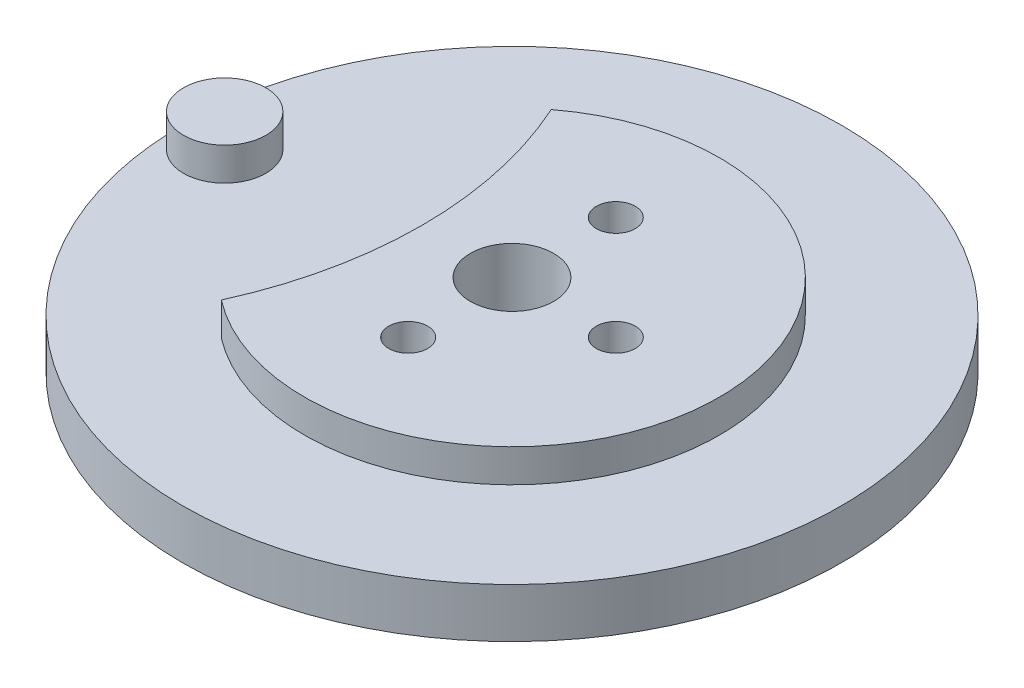
ISO-10303-21;
HEADER;
FILE_DESCRIPTION(('STEP AP214'),'2;1');
FILE_NAME('part.step','',(''),(''),'','','');
FILE_SCHEMA(('AUTOMOTIVE_DESIGN { 1 0 10303 214 1 1 1 1 }'));
ENDSEC;
DATA;
#1=APPLICATION_CONTEXT('core data for automotive mechanical design processes');
#2=APPLICATION_PROTOCOL_DEFINITION('international standard','automotive_design',2000,#1);
#3=PRODUCT_CONTEXT('',#1,'mechanical');
#4=PRODUCT('Part','Part','',(#3));
#5=PRODUCT_RELATED_PRODUCT_CATEGORY('part','',(#4));
#6=PRODUCT_DEFINITION_FORMATION('','',#4);
#7=PRODUCT_DEFINITION_CONTEXT('part definition',#1,'design');
#8=PRODUCT_DEFINITION('design','',#6,#7);
#9=PRODUCT_DEFINITION_SHAPE('','',#8);
#10=(LENGTH_UNIT() NAMED_UNIT(*) SI_UNIT(.MILLI.,.METRE.));
#11=(NAMED_UNIT(*) PLANE_ANGLE_UNIT() SI_UNIT($,.RADIAN.));
#12=(NAMED_UNIT(*) SI_UNIT($,.STERADIAN.) SOLID_ANGLE_UNIT());
#13=UNCERTAINTY_MEASURE_WITH_UNIT(LENGTH_MEASURE(1.E-05),#10,'distance_accuracy_value','');
#14=(GEOMETRIC_REPRESENTATION_CONTEXT(3) GLOBAL_UNCERTAINTY_ASSIGNED_CONTEXT((#13)) GLOBAL_UNIT_ASSIGNED_CONTEXT((#10,
#11,#12)) REPRESENTATION_CONTEXT('',''));
#15=CARTESIAN_POINT('',(0.,0.,0.));
#16=DIRECTION('',(0.,0.,1.));
#17=DIRECTION('',(1.,0.,0.));
#18=AXIS2_PLACEMENT_3D('',#15,#16,#17);
#19=CARTESIAN_POINT('',(37.6753519541933,0.,0.));
#20=DIRECTION('',(0.,1.,0.));
#21=DIRECTION('',(0.,0.,1.));
#22=AXIS2_PLACEMENT_3D('',#19,#20,#21);
#23=PLANE('',#22);
#24=CARTESIAN_POINT('',(15.5303357005903,0.,0.));
#25=DIRECTION('',(0.,1.,0.));
#26=DIRECTION('',(0.,0.,1.));
#27=AXIS2_PLACEMENT_3D('',#24,#25,#26);
#28=CIRCLE('',#27,3.175);
#29=CARTESIAN_POINT('',(15.5303357005903,0.,3.175));
#30=VERTEX_POINT('',#29);
#31=EDGE_CURVE('E98',#30,#30,#28,.T.);
#32=ORIENTED_EDGE('',*,*,#31,.F.);
#33=EDGE_LOOP('',(#32));
#34=FACE_BOUND('',#33,.T.);
#35=CARTESIAN_POINT('',(37.6753519541933,0.,0.));
#36=DIRECTION('',(0.,1.,0.));
#37=DIRECTION('',(0.,0.,1.));
#38=AXIS2_PLACEMENT_3D('',#35,#36,#37);
#39=CIRCLE('',#38,25.4);
#40=CARTESIAN_POINT('',(37.6753519541933,0.,25.4));
#41=VERTEX_POINT('',#40);
#42=EDGE_CURVE('E47',#41,#41,#39,.T.);
#43=ORIENTED_EDGE('',*,*,#42,.T.);
#44=EDGE_LOOP('',(#43));
#45=FACE_BOUND('',#44,.T.);
#46=CARTESIAN_POINT('',(0.,0.,0.));
#47=DIRECTION('',(0.,-1.,0.));
#48=DIRECTION('',(0.,0.,-1.));
#49=AXIS2_PLACEMENT_3D('',#46,#47,#48);
#50=CIRCLE('',#49,30.734);
#51=CARTESIAN_POINT('',(27.9809558245366,0.,-12.7139634711341));
#52=VERTEX_POINT('',#51);
#53=CARTESIAN_POINT('',(27.9809558245366,0.,12.713963471134));
#54=VERTEX_POINT('',#53);
#55=EDGE_CURVE('E74',#52,#54,#50,.T.);
#56=ORIENTED_EDGE('',*,*,#55,.F.);
#57=CARTESIAN_POINT('',(37.6753519541933,0.,0.));
#58=DIRECTION('',(0.,1.,0.));
#59=DIRECTION('',(0.,0.,-1.));
#60=AXIS2_PLACEMENT_3D('',#57,#58,#59);
#61=CIRCLE('',#60,15.9883139656449);
#62=EDGE_CURVE('E59',#54,#52,#61,.T.);
#63=ORIENTED_EDGE('',*,*,#62,.F.);
#64=EDGE_LOOP('',(#56,#63));
#65=FACE_BOUND('',#64,.T.);
#66=ADVANCED_FACE('F43',(#34,#45,#65),#23,.T.);
#67=CARTESIAN_POINT('',(37.6753519541933,-3.81,0.));
#68=DIRECTION('',(0.,1.,0.));
#69=DIRECTION('',(0.,0.,1.));
#70=AXIS2_PLACEMENT_3D('',#67,#68,#69);
#71=CYLINDRICAL_SURFACE('',#70,25.4);
#72=CARTESIAN_POINT('',(37.6753519541933,-3.81,0.));
#73=DIRECTION('',(0.,1.,0.));
#74=DIRECTION('',(0.,0.,1.));
#75=AXIS2_PLACEMENT_3D('',#72,#73,#74);
#76=CIRCLE('',#75,25.4);
#77=CARTESIAN_POINT('',(37.6753519541933,-3.81,25.4));
#78=VERTEX_POINT('',#77);
#79=EDGE_CURVE('E12',#78,#78,#76,.T.);
#80=ORIENTED_EDGE('',*,*,#79,.T.);
#81=EDGE_LOOP('',(#80));
#82=FACE_BOUND('',#81,.T.);
#83=ORIENTED_EDGE('',*,*,#42,.F.);
#84=EDGE_LOOP('',(#83));
#85=FACE_BOUND('',#84,.T.);
#86=ADVANCED_FACE('F45',(#82,#85),#71,.T.);
#87=CARTESIAN_POINT('',(37.6753519541933,-3.81,0.));
#88=DIRECTION('',(0.,1.,0.));
#89=DIRECTION('',(0.,0.,1.));
#90=AXIS2_PLACEMENT_3D('',#87,#88,#89);
#91=PLANE('',#90);
#92=CARTESIAN_POINT('',(37.6753519541933,-3.81,8.));
#93=DIRECTION('',(0.,1.,0.));
#94=DIRECTION('',(0.,0.,1.));
#95=AXIS2_PLACEMENT_3D('',#92,#93,#94);
#96=CIRCLE('',#95,1.5);
#97=CARTESIAN_POINT('',(37.6753519541933,-3.81,9.5));
#98=VERTEX_POINT('',#97);
#99=EDGE_CURVE('E279',#98,#98,#96,.T.);
#100=ORIENTED_EDGE('',*,*,#99,.T.);
#101=EDGE_LOOP('',(#100));
#102=FACE_BOUND('',#101,.T.);
#103=CARTESIAN_POINT('',(45.6753519541933,-3.81,0.));
#104=DIRECTION('',(0.,1.,0.));
#105=DIRECTION('',(0.,0.,1.));
#106=AXIS2_PLACEMENT_3D('',#103,#104,#105);
#107=CIRCLE('',#106,1.5);
#108=CARTESIAN_POINT('',(45.6753519541933,-3.81,1.5));
#109=VERTEX_POINT('',#108);
#110=EDGE_CURVE('E284',#109,#109,#107,.T.);
#111=ORIENTED_EDGE('',*,*,#110,.T.);
#112=EDGE_LOOP('',(#111));
#113=FACE_BOUND('',#112,.T.);
#114=CARTESIAN_POINT('',(37.6753519541933,-3.81,-8.));
#115=DIRECTION('',(0.,1.,0.));
#116=DIRECTION('',(0.,0.,1.));
#117=AXIS2_PLACEMENT_3D('',#114,#115,#116);
#118=CIRCLE('',#117,1.5);
#119=CARTESIAN_POINT('',(37.6753519541933,-3.81,-6.49999999999999));
#120=VERTEX_POINT('',#119);
#121=EDGE_CURVE('E280',#120,#120,#118,.T.);
#122=ORIENTED_EDGE('',*,*,#121,.T.);
#123=EDGE_LOOP('',(#122));
#124=FACE_BOUND('',#123,.T.);
#125=CARTESIAN_POINT('',(37.6753519541933,-3.81,0.));
#126=DIRECTION('',(0.,1.,0.));
#127=DIRECTION('',(0.,0.,1.));
#128=AXIS2_PLACEMENT_3D('',#125,#126,#127);
#129=CIRCLE('',#128,3.2131);
#130=CARTESIAN_POINT('',(37.6753519541933,-3.81,3.2131));
#131=VERTEX_POINT('',#130);
#132=EDGE_CURVE('E85',#131,#131,#129,.T.);
#133=ORIENTED_EDGE('',*,*,#132,.T.);
#134=EDGE_LOOP('',(#133));
#135=FACE_BOUND('',#134,.T.);
#136=ORIENTED_EDGE('',*,*,#79,.F.);
#137=EDGE_LOOP('',(#136));
#138=FACE_BOUND('',#137,.T.);
#139=ADVANCED_FACE('F112',(#102,#113,#124,#135,#138),#91,.F.);
#140=CARTESIAN_POINT('',(15.5303357005903,-12.7902561210692,0.));
#141=DIRECTION('',(0.,1.,0.));
#142=DIRECTION('',(0.,0.,1.));
#143=AXIS2_PLACEMENT_3D('',#140,#141,#142);
#144=CYLINDRICAL_SURFACE('',#143,3.175);
#145=ORIENTED_EDGE('',*,*,#31,.T.);
#146=EDGE_LOOP('',(#145));
#147=FACE_BOUND('',#146,.T.);
#148=CARTESIAN_POINT('',(15.5303357005903,2.54,0.));
#149=DIRECTION('',(0.,1.,0.));
#150=DIRECTION('',(0.,0.,1.));
#151=AXIS2_PLACEMENT_3D('',#148,#149,#150);
#152=CIRCLE('',#151,3.175);
#153=CARTESIAN_POINT('',(15.5303357005903,2.54,3.175));
#154=VERTEX_POINT('',#153);
#155=EDGE_CURVE('E101',#154,#154,#152,.T.);
#156=ORIENTED_EDGE('',*,*,#155,.F.);
#157=EDGE_LOOP('',(#156));
#158=FACE_BOUND('',#157,.T.);
#159=ADVANCED_FACE('F110',(#147,#158),#144,.T.);
#160=CARTESIAN_POINT('',(15.5303357005903,2.54,0.));
#161=DIRECTION('',(0.,1.,0.));
#162=DIRECTION('',(0.,0.,1.));
#163=AXIS2_PLACEMENT_3D('',#160,#161,#162);
#164=PLANE('',#163);
#165=ORIENTED_EDGE('',*,*,#155,.T.);
#166=EDGE_LOOP('',(#165));
#167=FACE_BOUND('',#166,.T.);
#168=ADVANCED_FACE('F108',(#167),#164,.T.);
#169=CARTESIAN_POINT('',(37.6753519541933,2.54,0.));
#170=DIRECTION('',(0.,-1.,0.));
#171=DIRECTION('',(0.,0.,-1.));
#172=AXIS2_PLACEMENT_3D('',#169,#170,#171);
#173=CYLINDRICAL_SURFACE('',#172,15.9883139656449);
#174=ORIENTED_EDGE('',*,*,#62,.T.);
#175=DIRECTION('',(0.,-1.,0.));
#176=VECTOR('',#175,1.);
#177=CARTESIAN_POINT('',(27.9809558245366,2.54,-12.7139634711341));
#178=LINE('',#177,#176);
#179=CARTESIAN_POINT('',(27.9809558245366,2.54,-12.7139634711341));
#180=VERTEX_POINT('',#179);
#181=EDGE_CURVE('E78',#180,#52,#178,.T.);
#182=ORIENTED_EDGE('',*,*,#181,.F.);
#183=CARTESIAN_POINT('',(37.6753519541933,2.54,0.));
#184=DIRECTION('',(0.,1.,0.));
#185=DIRECTION('',(0.,0.,-1.));
#186=AXIS2_PLACEMENT_3D('',#183,#184,#185);
#187=CIRCLE('',#186,15.9883139656449);
#188=CARTESIAN_POINT('',(27.9809558245366,2.54,12.713963471134));
#189=VERTEX_POINT('',#188);
#190=EDGE_CURVE('E80',#189,#180,#187,.T.);
#191=ORIENTED_EDGE('',*,*,#190,.F.);
#192=DIRECTION('',(0.,-1.,0.));
#193=VECTOR('',#192,1.);
#194=CARTESIAN_POINT('',(27.9809558245366,2.54,12.713963471134));
#195=LINE('',#194,#193);
#196=EDGE_CURVE('E76',#189,#54,#195,.T.);
#197=ORIENTED_EDGE('',*,*,#196,.T.);
#198=EDGE_LOOP('',(#174,#182,#191,#197));
#199=FACE_BOUND('',#198,.T.);
#200=ADVANCED_FACE('F82',(#199),#173,.T.);
#201=CARTESIAN_POINT('',(0.,2.54,0.));
#202=DIRECTION('',(0.,-1.,0.));
#203=DIRECTION('',(0.,0.,-1.));
#204=AXIS2_PLACEMENT_3D('',#201,#202,#203);
#205=CYLINDRICAL_SURFACE('',#204,30.734);
#206=ORIENTED_EDGE('',*,*,#55,.T.);
#207=ORIENTED_EDGE('',*,*,#196,.F.);
#208=CARTESIAN_POINT('',(0.,2.54,0.));
#209=DIRECTION('',(0.,-1.,0.));
#210=DIRECTION('',(0.,0.,-1.));
#211=AXIS2_PLACEMENT_3D('',#208,#209,#210);
#212=CIRCLE('',#211,30.734);
#213=EDGE_CURVE('E67',#180,#189,#212,.T.);
#214=ORIENTED_EDGE('',*,*,#213,.F.);
#215=ORIENTED_EDGE('',*,*,#181,.T.);
#216=EDGE_LOOP('',(#206,#207,#214,#215));
#217=FACE_BOUND('',#216,.T.);
#218=ADVANCED_FACE('F75',(#217),#205,.F.);
#219=CARTESIAN_POINT('',(18.8376759770967,2.54,0.));
#220=DIRECTION('',(0.,-1.,0.));
#221=DIRECTION('',(0.,0.,-1.));
#222=AXIS2_PLACEMENT_3D('',#219,#220,#221);
#223=PLANE('',#222);
#224=CARTESIAN_POINT('',(37.6753519541933,2.54,8.));
#225=DIRECTION('',(0.,1.,0.));
#226=DIRECTION('',(0.,0.,1.));
#227=AXIS2_PLACEMENT_3D('',#224,#225,#226);
#228=CIRCLE('',#227,1.5);
#229=CARTESIAN_POINT('',(37.6753519541933,2.54,9.5));
#230=VERTEX_POINT('',#229);
#231=EDGE_CURVE('E266',#230,#230,#228,.T.);
#232=ORIENTED_EDGE('',*,*,#231,.F.);
#233=EDGE_LOOP('',(#232));
#234=FACE_BOUND('',#233,.T.);
#235=CARTESIAN_POINT('',(45.6753519541933,2.54,0.));
#236=DIRECTION('',(0.,1.,0.));
#237=DIRECTION('',(0.,0.,1.));
#238=AXIS2_PLACEMENT_3D('',#235,#236,#237);
#239=CIRCLE('',#238,1.5);
#240=CARTESIAN_POINT('',(45.6753519541933,2.54,1.5));
#241=VERTEX_POINT('',#240);
#242=EDGE_CURVE('E270',#241,#241,#239,.T.);
#243=ORIENTED_EDGE('',*,*,#242,.F.);
#244=EDGE_LOOP('',(#243));
#245=FACE_BOUND('',#244,.T.);
#246=CARTESIAN_POINT('',(37.6753519541933,2.54,-8.));
#247=DIRECTION('',(0.,1.,0.));
#248=DIRECTION('',(0.,0.,1.));
#249=AXIS2_PLACEMENT_3D('',#246,#247,#248);
#250=CIRCLE('',#249,1.5);
#251=CARTESIAN_POINT('',(37.6753519541933,2.54,-6.49999999999999));
#252=VERTEX_POINT('',#251);
#253=EDGE_CURVE('E274',#252,#252,#250,.T.);
#254=ORIENTED_EDGE('',*,*,#253,.F.);
#255=EDGE_LOOP('',(#254));
#256=FACE_BOUND('',#255,.T.);
#257=CARTESIAN_POINT('',(37.6753519541933,2.54,0.));
#258=DIRECTION('',(0.,1.,0.));
#259=DIRECTION('',(0.,0.,1.));
#260=AXIS2_PLACEMENT_3D('',#257,#258,#259);
#261=CIRCLE('',#260,3.2131);
#262=CARTESIAN_POINT('',(37.6753519541933,2.54,3.2131));
#263=VERTEX_POINT('',#262);
#264=EDGE_CURVE('E89',#263,#263,#261,.T.);
#265=ORIENTED_EDGE('',*,*,#264,.F.);
#266=EDGE_LOOP('',(#265));
#267=FACE_BOUND('',#266,.T.);
#268=ORIENTED_EDGE('',*,*,#190,.T.);
#269=ORIENTED_EDGE('',*,*,#213,.T.);
#270=EDGE_LOOP('',(#268,#269));
#271=FACE_BOUND('',#270,.T.);
#272=ADVANCED_FACE('F159',(#234,#245,#256,#267,#271),#223,.F.);
#273=CARTESIAN_POINT('',(37.6753519541933,-3.81,0.));
#274=DIRECTION('',(0.,1.,0.));
#275=DIRECTION('',(0.,0.,1.));
#276=AXIS2_PLACEMENT_3D('',#273,#274,#275);
#277=CYLINDRICAL_SURFACE('',#276,3.2131);
#278=ORIENTED_EDGE('',*,*,#132,.F.);
#279=EDGE_LOOP('',(#278));
#280=FACE_BOUND('',#279,.T.);
#281=ORIENTED_EDGE('',*,*,#264,.T.);
#282=EDGE_LOOP('',(#281));
#283=FACE_BOUND('',#282,.T.);
#284=ADVANCED_FACE('F167',(#280,#283),#277,.F.);
#285=CARTESIAN_POINT('',(37.6753519541933,-3.81,-8.));
#286=DIRECTION('',(0.,1.,0.));
#287=DIRECTION('',(0.,0.,1.));
#288=AXIS2_PLACEMENT_3D('',#285,#286,#287);
#289=CYLINDRICAL_SURFACE('',#288,1.5);
#290=ORIENTED_EDGE('',*,*,#121,.F.);
#291=EDGE_LOOP('',(#290));
#292=FACE_BOUND('',#291,.T.);
#293=ORIENTED_EDGE('',*,*,#253,.T.);
#294=EDGE_LOOP('',(#293));
#295=FACE_BOUND('',#294,.T.);
#296=ADVANCED_FACE('F171',(#292,#295),#289,.F.);
#297=CARTESIAN_POINT('',(45.6753519541933,-3.81,0.));
#298=DIRECTION('',(0.,1.,0.));
#299=DIRECTION('',(0.,0.,1.));
#300=AXIS2_PLACEMENT_3D('',#297,#298,#299);
#301=CYLINDRICAL_SURFACE('',#300,1.5);
#302=ORIENTED_EDGE('',*,*,#110,.F.);
#303=EDGE_LOOP('',(#302));
#304=FACE_BOUND('',#303,.T.);
#305=ORIENTED_EDGE('',*,*,#242,.T.);
#306=EDGE_LOOP('',(#305));
#307=FACE_BOUND('',#306,.T.);
#308=ADVANCED_FACE('F181',(#304,#307),#301,.F.);
#309=CARTESIAN_POINT('',(37.6753519541933,-3.81,8.));
#310=DIRECTION('',(0.,1.,0.));
#311=DIRECTION('',(0.,0.,1.));
#312=AXIS2_PLACEMENT_3D('',#309,#310,#311);
#313=CYLINDRICAL_SURFACE('',#312,1.5);
#314=ORIENTED_EDGE('',*,*,#99,.F.);
#315=EDGE_LOOP('',(#314));
#316=FACE_BOUND('',#315,.T.);
#317=ORIENTED_EDGE('',*,*,#231,.T.);
#318=EDGE_LOOP('',(#317));
#319=FACE_BOUND('',#318,.T.);
#320=ADVANCED_FACE('F191',(#316,#319),#313,.F.);
#321=CLOSED_SHELL('',(#66,#86,#139,#159,#168,#200,#218,#272,#284,#296,#308,#320));
#322=MANIFOLD_SOLID_BREP('B2',#321);
#323=ADVANCED_BREP_SHAPE_REPRESENTATION('',(#18,#322),#14);
#324=SHAPE_DEFINITION_REPRESENTATION(#9,#323);
ENDSEC;
END-ISO-10303-21;
